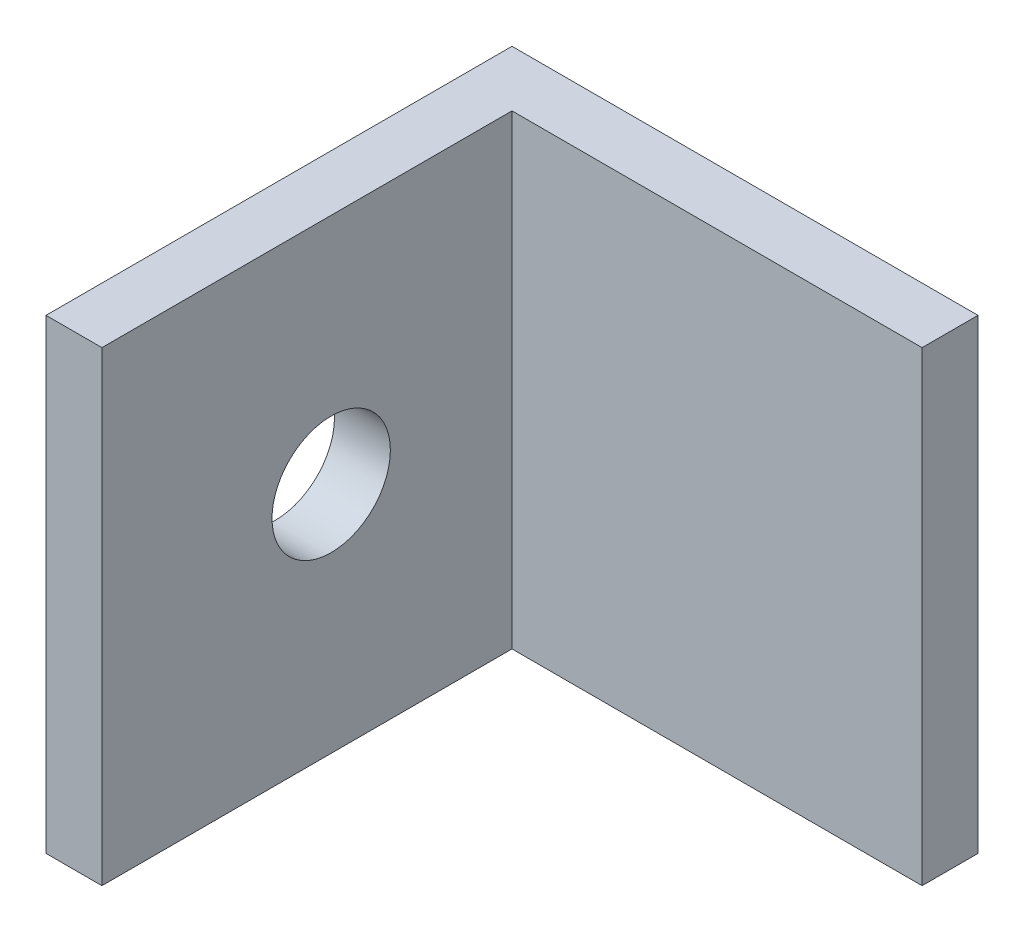
ISO-10303-21;
HEADER;
FILE_DESCRIPTION(('STEP AP214'),'2;1');
FILE_NAME('part.step','',(''),(''),'','','');
FILE_SCHEMA(('AUTOMOTIVE_DESIGN { 1 0 10303 214 1 1 1 1 }'));
ENDSEC;
DATA;
#1=APPLICATION_CONTEXT('core data for automotive mechanical design processes');
#2=APPLICATION_PROTOCOL_DEFINITION('international standard','automotive_design',2000,#1);
#3=PRODUCT_CONTEXT('',#1,'mechanical');
#4=PRODUCT('Part','Part','',(#3));
#5=PRODUCT_RELATED_PRODUCT_CATEGORY('part','',(#4));
#6=PRODUCT_DEFINITION_FORMATION('','',#4);
#7=PRODUCT_DEFINITION_CONTEXT('part definition',#1,'design');
#8=PRODUCT_DEFINITION('design','',#6,#7);
#9=PRODUCT_DEFINITION_SHAPE('','',#8);
#10=(LENGTH_UNIT() NAMED_UNIT(*) SI_UNIT(.MILLI.,.METRE.));
#11=(NAMED_UNIT(*) PLANE_ANGLE_UNIT() SI_UNIT($,.RADIAN.));
#12=(NAMED_UNIT(*) SI_UNIT($,.STERADIAN.) SOLID_ANGLE_UNIT());
#13=UNCERTAINTY_MEASURE_WITH_UNIT(LENGTH_MEASURE(1.E-05),#10,'distance_accuracy_value','');
#14=(GEOMETRIC_REPRESENTATION_CONTEXT(3) GLOBAL_UNCERTAINTY_ASSIGNED_CONTEXT((#13)) GLOBAL_UNIT_ASSIGNED_CONTEXT((#10,
#11,#12)) REPRESENTATION_CONTEXT('',''));
#15=CARTESIAN_POINT('',(0.,0.,0.));
#16=DIRECTION('',(0.,0.,1.));
#17=DIRECTION('',(1.,0.,0.));
#18=AXIS2_PLACEMENT_3D('',#15,#16,#17);
#19=CARTESIAN_POINT('',(25.,25.,6.28366136050193));
#20=DIRECTION('',(1.,0.,0.));
#21=DIRECTION('',(0.,0.,-1.));
#22=AXIS2_PLACEMENT_3D('',#19,#20,#21);
#23=PLANE('',#22);
#24=DIRECTION('',(0.,0.,1.));
#25=VECTOR('',#24,1.);
#26=CARTESIAN_POINT('',(25.,0.,6.28366136050193));
#27=LINE('',#26,#25);
#28=CARTESIAN_POINT('',(25.,0.,0.));
#29=VERTEX_POINT('',#28);
#30=CARTESIAN_POINT('',(25.,0.,3.));
#31=VERTEX_POINT('',#30);
#32=EDGE_CURVE('E113',#29,#31,#27,.T.);
#33=ORIENTED_EDGE('',*,*,#32,.F.);
#34=DIRECTION('',(0.,-1.,0.));
#35=VECTOR('',#34,1.);
#36=CARTESIAN_POINT('',(25.,25.,0.));
#37=LINE('',#36,#35);
#38=CARTESIAN_POINT('',(25.,25.,0.));
#39=VERTEX_POINT('',#38);
#40=EDGE_CURVE('E11',#39,#29,#37,.T.);
#41=ORIENTED_EDGE('',*,*,#40,.F.);
#42=DIRECTION('',(0.,0.,1.));
#43=VECTOR('',#42,1.);
#44=CARTESIAN_POINT('',(25.,25.,6.28366136050193));
#45=LINE('',#44,#43);
#46=CARTESIAN_POINT('',(25.,25.,3.));
#47=VERTEX_POINT('',#46);
#48=EDGE_CURVE('E127',#39,#47,#45,.T.);
#49=ORIENTED_EDGE('',*,*,#48,.T.);
#50=DIRECTION('',(0.,-1.,0.));
#51=VECTOR('',#50,1.);
#52=CARTESIAN_POINT('',(25.,25.,3.));
#53=LINE('',#52,#51);
#54=EDGE_CURVE('E75',#47,#31,#53,.T.);
#55=ORIENTED_EDGE('',*,*,#54,.T.);
#56=EDGE_LOOP('',(#33,#41,#49,#55));
#57=FACE_BOUND('',#56,.T.);
#58=ADVANCED_FACE('F31',(#57),#23,.T.);
#59=CARTESIAN_POINT('',(-25.637536216163,25.,0.));
#60=DIRECTION('',(0.,0.,-1.));
#61=DIRECTION('',(-1.,0.,0.));
#62=AXIS2_PLACEMENT_3D('',#59,#60,#61);
#63=PLANE('',#62);
#64=DIRECTION('',(1.,0.,0.));
#65=VECTOR('',#64,1.);
#66=CARTESIAN_POINT('',(-25.637536216163,0.,0.));
#67=LINE('',#66,#65);
#68=CARTESIAN_POINT('',(0.,0.,0.));
#69=VERTEX_POINT('',#68);
#70=EDGE_CURVE('E116',#69,#29,#67,.T.);
#71=ORIENTED_EDGE('',*,*,#70,.F.);
#72=DIRECTION('',(0.,-1.,0.));
#73=VECTOR('',#72,1.);
#74=CARTESIAN_POINT('',(0.,25.,0.));
#75=LINE('',#74,#73);
#76=CARTESIAN_POINT('',(0.,25.,0.));
#77=VERTEX_POINT('',#76);
#78=EDGE_CURVE('E39',#77,#69,#75,.T.);
#79=ORIENTED_EDGE('',*,*,#78,.F.);
#80=DIRECTION('',(1.,0.,0.));
#81=VECTOR('',#80,1.);
#82=CARTESIAN_POINT('',(-25.637536216163,25.,0.));
#83=LINE('',#82,#81);
#84=EDGE_CURVE('E139',#77,#39,#83,.T.);
#85=ORIENTED_EDGE('',*,*,#84,.T.);
#86=ORIENTED_EDGE('',*,*,#40,.T.);
#87=EDGE_LOOP('',(#71,#79,#85,#86));
#88=FACE_BOUND('',#87,.T.);
#89=ADVANCED_FACE('F138',(#88),#63,.T.);
#90=CARTESIAN_POINT('',(0.,25.,6.28366136050192));
#91=DIRECTION('',(1.,0.,0.));
#92=DIRECTION('',(0.,0.,-1.));
#93=AXIS2_PLACEMENT_3D('',#90,#91,#92);
#94=PLANE('',#93);
#95=CARTESIAN_POINT('',(0.,12.5,12.7));
#96=DIRECTION('',(1.,0.,0.));
#97=DIRECTION('',(0.,0.,-1.));
#98=AXIS2_PLACEMENT_3D('',#95,#96,#97);
#99=CIRCLE('',#98,3.175);
#100=CARTESIAN_POINT('',(0.,12.5,9.525));
#101=VERTEX_POINT('',#100);
#102=EDGE_CURVE('E117',#101,#101,#99,.T.);
#103=ORIENTED_EDGE('',*,*,#102,.T.);
#104=EDGE_LOOP('',(#103));
#105=FACE_BOUND('',#104,.T.);
#106=DIRECTION('',(0.,0.,1.));
#107=VECTOR('',#106,1.);
#108=CARTESIAN_POINT('',(0.,0.,6.28366136050192));
#109=LINE('',#108,#107);
#110=CARTESIAN_POINT('',(0.,0.,25.));
#111=VERTEX_POINT('',#110);
#112=EDGE_CURVE('E120',#69,#111,#109,.T.);
#113=ORIENTED_EDGE('',*,*,#112,.T.);
#114=DIRECTION('',(0.,-1.,0.));
#115=VECTOR('',#114,1.);
#116=CARTESIAN_POINT('',(0.,25.,25.));
#117=LINE('',#116,#115);
#118=CARTESIAN_POINT('',(0.,25.,25.));
#119=VERTEX_POINT('',#118);
#120=EDGE_CURVE('E106',#119,#111,#117,.T.);
#121=ORIENTED_EDGE('',*,*,#120,.F.);
#122=DIRECTION('',(0.,0.,1.));
#123=VECTOR('',#122,1.);
#124=CARTESIAN_POINT('',(0.,25.,6.28366136050192));
#125=LINE('',#124,#123);
#126=EDGE_CURVE('E93',#77,#119,#125,.T.);
#127=ORIENTED_EDGE('',*,*,#126,.F.);
#128=ORIENTED_EDGE('',*,*,#78,.T.);
#129=EDGE_LOOP('',(#113,#121,#127,#128));
#130=FACE_BOUND('',#129,.T.);
#131=ADVANCED_FACE('F132',(#105,#130),#94,.F.);
#132=CARTESIAN_POINT('',(-25.637536216163,25.,25.));
#133=DIRECTION('',(0.,0.,-1.));
#134=DIRECTION('',(-1.,0.,0.));
#135=AXIS2_PLACEMENT_3D('',#132,#133,#134);
#136=PLANE('',#135);
#137=DIRECTION('',(1.,0.,0.));
#138=VECTOR('',#137,1.);
#139=CARTESIAN_POINT('',(-25.637536216163,0.,25.));
#140=LINE('',#139,#138);
#141=CARTESIAN_POINT('',(3.,0.,25.));
#142=VERTEX_POINT('',#141);
#143=EDGE_CURVE('E102',#111,#142,#140,.T.);
#144=ORIENTED_EDGE('',*,*,#143,.T.);
#145=DIRECTION('',(0.,-1.,0.));
#146=VECTOR('',#145,1.);
#147=CARTESIAN_POINT('',(3.,25.,25.));
#148=LINE('',#147,#146);
#149=CARTESIAN_POINT('',(3.,25.,25.));
#150=VERTEX_POINT('',#149);
#151=EDGE_CURVE('E99',#150,#142,#148,.T.);
#152=ORIENTED_EDGE('',*,*,#151,.F.);
#153=DIRECTION('',(1.,0.,0.));
#154=VECTOR('',#153,1.);
#155=CARTESIAN_POINT('',(-25.637536216163,25.,25.));
#156=LINE('',#155,#154);
#157=EDGE_CURVE('E86',#119,#150,#156,.T.);
#158=ORIENTED_EDGE('',*,*,#157,.F.);
#159=ORIENTED_EDGE('',*,*,#120,.T.);
#160=EDGE_LOOP('',(#144,#152,#158,#159));
#161=FACE_BOUND('',#160,.T.);
#162=ADVANCED_FACE('F100',(#161),#136,.F.);
#163=CARTESIAN_POINT('',(3.,25.,6.28366136050192));
#164=DIRECTION('',(1.,0.,0.));
#165=DIRECTION('',(0.,0.,-1.));
#166=AXIS2_PLACEMENT_3D('',#163,#164,#165);
#167=PLANE('',#166);
#168=CARTESIAN_POINT('',(3.,12.5,12.7));
#169=DIRECTION('',(1.,0.,0.));
#170=DIRECTION('',(0.,0.,-1.));
#171=AXIS2_PLACEMENT_3D('',#168,#169,#170);
#172=CIRCLE('',#171,3.175);
#173=CARTESIAN_POINT('',(3.,12.5,9.525));
#174=VERTEX_POINT('',#173);
#175=EDGE_CURVE('E144',#174,#174,#172,.T.);
#176=ORIENTED_EDGE('',*,*,#175,.F.);
#177=EDGE_LOOP('',(#176));
#178=FACE_BOUND('',#177,.T.);
#179=DIRECTION('',(0.,0.,1.));
#180=VECTOR('',#179,1.);
#181=CARTESIAN_POINT('',(3.,0.,6.28366136050192));
#182=LINE('',#181,#180);
#183=CARTESIAN_POINT('',(3.,0.,3.));
#184=VERTEX_POINT('',#183);
#185=EDGE_CURVE('E123',#184,#142,#182,.T.);
#186=ORIENTED_EDGE('',*,*,#185,.F.);
#187=DIRECTION('',(0.,-1.,0.));
#188=VECTOR('',#187,1.);
#189=CARTESIAN_POINT('',(3.,25.,3.));
#190=LINE('',#189,#188);
#191=CARTESIAN_POINT('',(3.,25.,3.));
#192=VERTEX_POINT('',#191);
#193=EDGE_CURVE('E68',#192,#184,#190,.T.);
#194=ORIENTED_EDGE('',*,*,#193,.F.);
#195=DIRECTION('',(0.,0.,1.));
#196=VECTOR('',#195,1.);
#197=CARTESIAN_POINT('',(3.,25.,6.28366136050192));
#198=LINE('',#197,#196);
#199=EDGE_CURVE('E90',#192,#150,#198,.T.);
#200=ORIENTED_EDGE('',*,*,#199,.T.);
#201=ORIENTED_EDGE('',*,*,#151,.T.);
#202=EDGE_LOOP('',(#186,#194,#200,#201));
#203=FACE_BOUND('',#202,.T.);
#204=ADVANCED_FACE('F108',(#178,#203),#167,.T.);
#205=CARTESIAN_POINT('',(-25.637536216163,25.,3.));
#206=DIRECTION('',(0.,0.,-1.));
#207=DIRECTION('',(-1.,0.,0.));
#208=AXIS2_PLACEMENT_3D('',#205,#206,#207);
#209=PLANE('',#208);
#210=DIRECTION('',(1.,0.,0.));
#211=VECTOR('',#210,1.);
#212=CARTESIAN_POINT('',(-25.637536216163,0.,3.));
#213=LINE('',#212,#211);
#214=EDGE_CURVE('E125',#184,#31,#213,.T.);
#215=ORIENTED_EDGE('',*,*,#214,.T.);
#216=ORIENTED_EDGE('',*,*,#54,.F.);
#217=DIRECTION('',(1.,0.,0.));
#218=VECTOR('',#217,1.);
#219=CARTESIAN_POINT('',(-25.637536216163,25.,3.));
#220=LINE('',#219,#218);
#221=EDGE_CURVE('E47',#192,#47,#220,.T.);
#222=ORIENTED_EDGE('',*,*,#221,.F.);
#223=ORIENTED_EDGE('',*,*,#193,.T.);
#224=EDGE_LOOP('',(#215,#216,#222,#223));
#225=FACE_BOUND('',#224,.T.);
#226=ADVANCED_FACE('F140',(#225),#209,.F.);
#227=CARTESIAN_POINT('',(-25.637536216163,25.,6.28366136050193));
#228=DIRECTION('',(0.,1.,0.));
#229=DIRECTION('',(0.,0.,1.));
#230=AXIS2_PLACEMENT_3D('',#227,#228,#229);
#231=PLANE('',#230);
#232=ORIENTED_EDGE('',*,*,#48,.F.);
#233=ORIENTED_EDGE('',*,*,#84,.F.);
#234=ORIENTED_EDGE('',*,*,#126,.T.);
#235=ORIENTED_EDGE('',*,*,#157,.T.);
#236=ORIENTED_EDGE('',*,*,#199,.F.);
#237=ORIENTED_EDGE('',*,*,#221,.T.);
#238=EDGE_LOOP('',(#232,#233,#234,#235,#236,#237));
#239=FACE_BOUND('',#238,.T.);
#240=ADVANCED_FACE('F88',(#239),#231,.T.);
#241=CARTESIAN_POINT('',(-25.637536216163,0.,6.28366136050193));
#242=DIRECTION('',(0.,1.,0.));
#243=DIRECTION('',(0.,0.,1.));
#244=AXIS2_PLACEMENT_3D('',#241,#242,#243);
#245=PLANE('',#244);
#246=ORIENTED_EDGE('',*,*,#32,.T.);
#247=ORIENTED_EDGE('',*,*,#214,.F.);
#248=ORIENTED_EDGE('',*,*,#185,.T.);
#249=ORIENTED_EDGE('',*,*,#143,.F.);
#250=ORIENTED_EDGE('',*,*,#112,.F.);
#251=ORIENTED_EDGE('',*,*,#70,.T.);
#252=EDGE_LOOP('',(#246,#247,#248,#249,#250,#251));
#253=FACE_BOUND('',#252,.T.);
#254=ADVANCED_FACE('F137',(#253),#245,.F.);
#255=CARTESIAN_POINT('',(0.,12.5,12.7));
#256=DIRECTION('',(1.,0.,0.));
#257=DIRECTION('',(0.,0.,-1.));
#258=AXIS2_PLACEMENT_3D('',#255,#256,#257);
#259=CYLINDRICAL_SURFACE('',#258,3.175);
#260=ORIENTED_EDGE('',*,*,#102,.F.);
#261=EDGE_LOOP('',(#260));
#262=FACE_BOUND('',#261,.T.);
#263=ORIENTED_EDGE('',*,*,#175,.T.);
#264=EDGE_LOOP('',(#263));
#265=FACE_BOUND('',#264,.T.);
#266=ADVANCED_FACE('F151',(#262,#265),#259,.F.);
#267=CLOSED_SHELL('',(#58,#89,#131,#162,#204,#226,#240,#254,#266));
#268=MANIFOLD_SOLID_BREP('B2',#267);
#269=ADVANCED_BREP_SHAPE_REPRESENTATION('',(#18,#268),#14);
#270=SHAPE_DEFINITION_REPRESENTATION(#9,#269);
ENDSEC;
END-ISO-10303-21;
